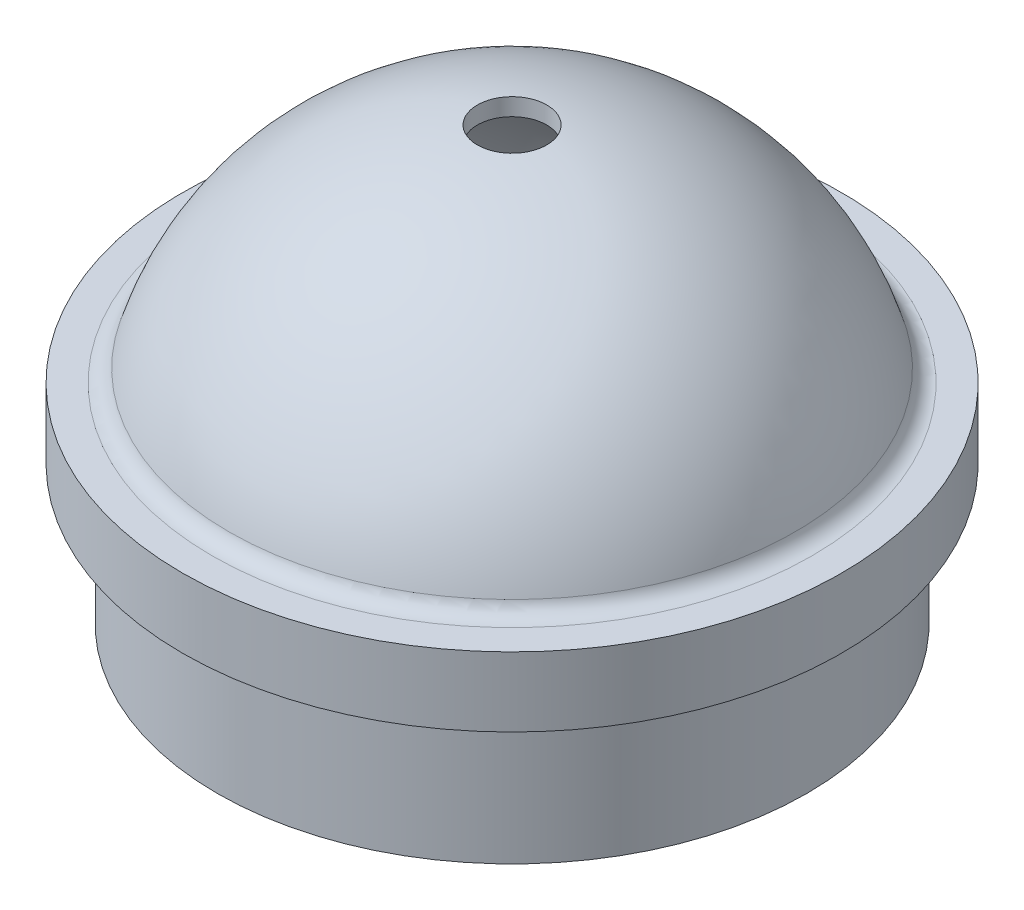
ISO-10303-21;
HEADER;
FILE_DESCRIPTION(('STEP AP214'),'2;1');
FILE_NAME('part.step','',(''),(''),'','','');
FILE_SCHEMA(('AUTOMOTIVE_DESIGN { 1 0 10303 214 1 1 1 1 }'));
ENDSEC;
DATA;
#1=APPLICATION_CONTEXT('core data for automotive mechanical design processes');
#2=APPLICATION_PROTOCOL_DEFINITION('international standard','automotive_design',2000,#1);
#3=PRODUCT_CONTEXT('',#1,'mechanical');
#4=PRODUCT('Part','Part','',(#3));
#5=PRODUCT_RELATED_PRODUCT_CATEGORY('part','',(#4));
#6=PRODUCT_DEFINITION_FORMATION('','',#4);
#7=PRODUCT_DEFINITION_CONTEXT('part definition',#1,'design');
#8=PRODUCT_DEFINITION('design','',#6,#7);
#9=PRODUCT_DEFINITION_SHAPE('','',#8);
#10=(LENGTH_UNIT() NAMED_UNIT(*) SI_UNIT(.MILLI.,.METRE.));
#11=(NAMED_UNIT(*) PLANE_ANGLE_UNIT() SI_UNIT($,.RADIAN.));
#12=(NAMED_UNIT(*) SI_UNIT($,.STERADIAN.) SOLID_ANGLE_UNIT());
#13=UNCERTAINTY_MEASURE_WITH_UNIT(LENGTH_MEASURE(1.E-05),#10,'distance_accuracy_value','');
#14=(GEOMETRIC_REPRESENTATION_CONTEXT(3) GLOBAL_UNCERTAINTY_ASSIGNED_CONTEXT((#13)) GLOBAL_UNIT_ASSIGNED_CONTEXT((#10,
#11,#12)) REPRESENTATION_CONTEXT('',''));
#15=CARTESIAN_POINT('',(0.,0.,0.));
#16=DIRECTION('',(0.,0.,1.));
#17=DIRECTION('',(1.,0.,0.));
#18=AXIS2_PLACEMENT_3D('',#15,#16,#17);
#19=CARTESIAN_POINT('',(-53.975,0.,0.));
#20=DIRECTION('',(0.,-1.,0.));
#21=DIRECTION('',(0.,0.,-1.));
#22=AXIS2_PLACEMENT_3D('',#19,#20,#21);
#23=PLANE('',#22);
#24=CARTESIAN_POINT('',(0.,0.,0.));
#25=DIRECTION('',(0.,1.,0.));
#26=DIRECTION('',(0.,0.,1.));
#27=AXIS2_PLACEMENT_3D('',#24,#25,#26);
#28=CIRCLE('',#27,50.8);
#29=CARTESIAN_POINT('',(0.,0.,50.8));
#30=VERTEX_POINT('',#29);
#31=EDGE_CURVE('E65',#30,#30,#28,.T.);
#32=ORIENTED_EDGE('',*,*,#31,.T.);
#33=EDGE_LOOP('',(#32));
#34=FACE_BOUND('',#33,.T.);
#35=CARTESIAN_POINT('',(0.,0.,0.));
#36=DIRECTION('',(0.,1.,0.));
#37=DIRECTION('',(0.,0.,1.));
#38=AXIS2_PLACEMENT_3D('',#35,#36,#37);
#39=CIRCLE('',#38,53.975);
#40=CARTESIAN_POINT('',(0.,0.,53.975));
#41=VERTEX_POINT('',#40);
#42=EDGE_CURVE('E10',#41,#41,#39,.T.);
#43=ORIENTED_EDGE('',*,*,#42,.F.);
#44=EDGE_LOOP('',(#43));
#45=FACE_BOUND('',#44,.T.);
#46=ADVANCED_FACE('F31',(#34,#45),#23,.T.);
#47=CARTESIAN_POINT('',(0.,121.236821391353,0.));
#48=DIRECTION('',(0.,1.,0.));
#49=DIRECTION('',(0.,0.,1.));
#50=AXIS2_PLACEMENT_3D('',#47,#48,#49);
#51=CYLINDRICAL_SURFACE('',#50,53.975);
#52=ORIENTED_EDGE('',*,*,#42,.T.);
#53=EDGE_LOOP('',(#52));
#54=FACE_BOUND('',#53,.T.);
#55=CARTESIAN_POINT('',(0.,25.4,0.));
#56=DIRECTION('',(0.,1.,0.));
#57=DIRECTION('',(0.,0.,1.));
#58=AXIS2_PLACEMENT_3D('',#55,#56,#57);
#59=CIRCLE('',#58,53.975);
#60=CARTESIAN_POINT('',(0.,25.4,53.975));
#61=VERTEX_POINT('',#60);
#62=EDGE_CURVE('E37',#61,#61,#59,.T.);
#63=ORIENTED_EDGE('',*,*,#62,.F.);
#64=EDGE_LOOP('',(#63));
#65=FACE_BOUND('',#64,.T.);
#66=ADVANCED_FACE('F83',(#54,#65),#51,.T.);
#67=CARTESIAN_POINT('',(-53.975,25.4,0.));
#68=DIRECTION('',(0.,-1.,0.));
#69=DIRECTION('',(0.,0.,-1.));
#70=AXIS2_PLACEMENT_3D('',#67,#68,#69);
#71=PLANE('',#70);
#72=ORIENTED_EDGE('',*,*,#62,.T.);
#73=EDGE_LOOP('',(#72));
#74=FACE_BOUND('',#73,.T.);
#75=CARTESIAN_POINT('',(0.,25.4,0.));
#76=DIRECTION('',(0.,1.,0.));
#77=DIRECTION('',(0.,0.,1.));
#78=AXIS2_PLACEMENT_3D('',#75,#76,#77);
#79=CIRCLE('',#78,60.325);
#80=CARTESIAN_POINT('',(0.,25.4,60.325));
#81=VERTEX_POINT('',#80);
#82=EDGE_CURVE('E41',#81,#81,#79,.T.);
#83=ORIENTED_EDGE('',*,*,#82,.F.);
#84=EDGE_LOOP('',(#83));
#85=FACE_BOUND('',#84,.T.);
#86=ADVANCED_FACE('F87',(#74,#85),#71,.T.);
#87=CARTESIAN_POINT('',(0.,121.236821391353,0.));
#88=DIRECTION('',(0.,1.,0.));
#89=DIRECTION('',(0.,0.,1.));
#90=AXIS2_PLACEMENT_3D('',#87,#88,#89);
#91=CYLINDRICAL_SURFACE('',#90,60.325);
#92=ORIENTED_EDGE('',*,*,#82,.T.);
#93=EDGE_LOOP('',(#92));
#94=FACE_BOUND('',#93,.T.);
#95=CARTESIAN_POINT('',(0.,38.1,0.));
#96=DIRECTION('',(0.,1.,0.));
#97=DIRECTION('',(0.,0.,1.));
#98=AXIS2_PLACEMENT_3D('',#95,#96,#97);
#99=CIRCLE('',#98,60.325);
#100=CARTESIAN_POINT('',(0.,38.1,60.325));
#101=VERTEX_POINT('',#100);
#102=EDGE_CURVE('E45',#101,#101,#99,.T.);
#103=ORIENTED_EDGE('',*,*,#102,.F.);
#104=EDGE_LOOP('',(#103));
#105=FACE_BOUND('',#104,.T.);
#106=ADVANCED_FACE('F91',(#94,#105),#91,.T.);
#107=CARTESIAN_POINT('',(-54.8764788981617,38.1,0.));
#108=DIRECTION('',(0.,1.,0.));
#109=DIRECTION('',(0.,0.,1.));
#110=AXIS2_PLACEMENT_3D('',#107,#108,#109);
#111=PLANE('',#110);
#112=ORIENTED_EDGE('',*,*,#102,.T.);
#113=EDGE_LOOP('',(#112));
#114=FACE_BOUND('',#113,.T.);
#115=CARTESIAN_POINT('',(0.,38.1,0.));
#116=DIRECTION('',(0.,1.,0.));
#117=DIRECTION('',(0.,0.,1.));
#118=AXIS2_PLACEMENT_3D('',#115,#116,#117);
#119=CIRCLE('',#118,54.8764788981617);
#120=CARTESIAN_POINT('',(0.,38.1,54.8764788981617));
#121=VERTEX_POINT('',#120);
#122=EDGE_CURVE('E50',#121,#121,#119,.T.);
#123=ORIENTED_EDGE('',*,*,#122,.F.);
#124=EDGE_LOOP('',(#123));
#125=FACE_BOUND('',#124,.T.);
#126=ADVANCED_FACE('F97',(#114,#125),#111,.T.);
#127=CARTESIAN_POINT('',(0.,41.275,0.));
#128=DIRECTION('',(0.,1.,0.));
#129=DIRECTION('',(0.,0.,1.));
#130=AXIS2_PLACEMENT_3D('',#127,#128,#129);
#131=TOROIDAL_SURFACE('',#130,54.8764788981617,3.17499999999999);
#132=ORIENTED_EDGE('',*,*,#122,.T.);
#133=EDGE_LOOP('',(#132));
#134=FACE_BOUND('',#133,.T.);
#135=CARTESIAN_POINT('',(0.,40.3926936387004,0.));
#136=DIRECTION('',(0.,1.,0.));
#137=DIRECTION('',(0.,0.,1.));
#138=AXIS2_PLACEMENT_3D('',#135,#136,#137);
#139=CIRCLE('',#138,51.8265345568974);
#140=CARTESIAN_POINT('',(0.,40.3926936387004,51.8265345568974));
#141=VERTEX_POINT('',#140);
#142=EDGE_CURVE('E53',#141,#141,#139,.T.);
#143=ORIENTED_EDGE('',*,*,#142,.F.);
#144=EDGE_LOOP('',(#143));
#145=FACE_BOUND('',#144,.T.);
#146=ADVANCED_FACE('F101',(#134,#145),#131,.F.);
#147=CARTESIAN_POINT('',(0.,25.4,0.));
#148=DIRECTION('',(0.,1.,0.));
#149=DIRECTION('',(-1.,0.,0.));
#150=AXIS2_PLACEMENT_3D('',#147,#148,#149);
#151=SPHERICAL_SURFACE('',#150,53.951557407745);
#152=ORIENTED_EDGE('',*,*,#142,.T.);
#153=EDGE_LOOP('',(#152));
#154=FACE_BOUND('',#153,.T.);
#155=CARTESIAN_POINT('',(0.,78.9765624757805,0.));
#156=DIRECTION('',(0.,1.,0.));
#157=DIRECTION('',(0.,0.,1.));
#158=AXIS2_PLACEMENT_3D('',#155,#156,#157);
#159=CIRCLE('',#158,6.35);
#160=CARTESIAN_POINT('',(0.,78.9765624757805,6.35));
#161=VERTEX_POINT('',#160);
#162=EDGE_CURVE('E56',#161,#161,#159,.T.);
#163=ORIENTED_EDGE('',*,*,#162,.F.);
#164=EDGE_LOOP('',(#163));
#165=FACE_BOUND('',#164,.T.);
#166=ADVANCED_FACE('F105',(#154,#165),#151,.T.);
#167=CARTESIAN_POINT('',(0.,121.236821391353,0.));
#168=DIRECTION('',(0.,1.,0.));
#169=DIRECTION('',(0.,0.,1.));
#170=AXIS2_PLACEMENT_3D('',#167,#168,#169);
#171=CYLINDRICAL_SURFACE('',#170,6.35);
#172=ORIENTED_EDGE('',*,*,#162,.T.);
#173=EDGE_LOOP('',(#172));
#174=FACE_BOUND('',#173,.T.);
#175=CARTESIAN_POINT('',(0.,75.8015624757805,0.));
#176=DIRECTION('',(0.,1.,0.));
#177=DIRECTION('',(0.,0.,1.));
#178=AXIS2_PLACEMENT_3D('',#175,#176,#177);
#179=CIRCLE('',#178,6.35);
#180=CARTESIAN_POINT('',(0.,75.8015624757805,6.35));
#181=VERTEX_POINT('',#180);
#182=EDGE_CURVE('E59',#181,#181,#179,.T.);
#183=ORIENTED_EDGE('',*,*,#182,.F.);
#184=EDGE_LOOP('',(#183));
#185=FACE_BOUND('',#184,.T.);
#186=ADVANCED_FACE('F79',(#174,#185),#171,.F.);
#187=CARTESIAN_POINT('',(0.,25.4,0.));
#188=DIRECTION('',(0.,1.,0.));
#189=DIRECTION('',(-1.,0.,0.));
#190=AXIS2_PLACEMENT_3D('',#187,#188,#189);
#191=SPHERICAL_SURFACE('',#190,50.8);
#192=ORIENTED_EDGE('',*,*,#182,.T.);
#193=EDGE_LOOP('',(#192));
#194=FACE_BOUND('',#193,.T.);
#195=CARTESIAN_POINT('',(0.,25.4,0.));
#196=DIRECTION('',(0.,1.,0.));
#197=DIRECTION('',(0.,0.,1.));
#198=AXIS2_PLACEMENT_3D('',#195,#196,#197);
#199=CIRCLE('',#198,50.8);
#200=CARTESIAN_POINT('',(0.,25.4,50.8));
#201=VERTEX_POINT('',#200);
#202=EDGE_CURVE('E62',#201,#201,#199,.T.);
#203=ORIENTED_EDGE('',*,*,#202,.F.);
#204=EDGE_LOOP('',(#203));
#205=FACE_BOUND('',#204,.T.);
#206=ADVANCED_FACE('F73',(#194,#205),#191,.F.);
#207=CARTESIAN_POINT('',(0.,121.236821391353,0.));
#208=DIRECTION('',(0.,1.,0.));
#209=DIRECTION('',(0.,0.,1.));
#210=AXIS2_PLACEMENT_3D('',#207,#208,#209);
#211=CYLINDRICAL_SURFACE('',#210,50.8);
#212=ORIENTED_EDGE('',*,*,#202,.T.);
#213=EDGE_LOOP('',(#212));
#214=FACE_BOUND('',#213,.T.);
#215=ORIENTED_EDGE('',*,*,#31,.F.);
#216=EDGE_LOOP('',(#215));
#217=FACE_BOUND('',#216,.T.);
#218=ADVANCED_FACE('F71',(#214,#217),#211,.F.);
#219=CLOSED_SHELL('',(#46,#66,#86,#106,#126,#146,#166,#186,#206,#218));
#220=MANIFOLD_SOLID_BREP('B2',#219);
#221=ADVANCED_BREP_SHAPE_REPRESENTATION('',(#18,#220),#14);
#222=SHAPE_DEFINITION_REPRESENTATION(#9,#221);
ENDSEC;
END-ISO-10303-21;
